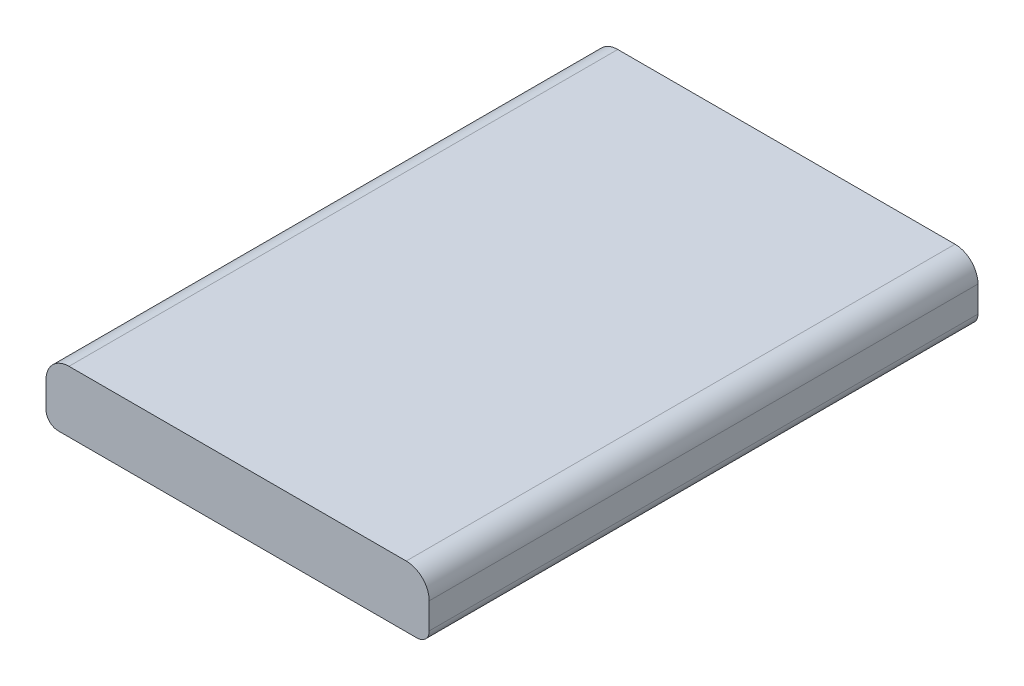
ISO-10303-21;
HEADER;
FILE_DESCRIPTION(('STEP AP214'),'2;1');
FILE_NAME('part.step','',(''),(''),'','','');
FILE_SCHEMA(('AUTOMOTIVE_DESIGN { 1 0 10303 214 1 1 1 1 }'));
ENDSEC;
DATA;
#1=APPLICATION_CONTEXT('core data for automotive mechanical design processes');
#2=APPLICATION_PROTOCOL_DEFINITION('international standard','automotive_design',2000,#1);
#3=PRODUCT_CONTEXT('',#1,'mechanical');
#4=PRODUCT('Part','Part','',(#3));
#5=PRODUCT_RELATED_PRODUCT_CATEGORY('part','',(#4));
#6=PRODUCT_DEFINITION_FORMATION('','',#4);
#7=PRODUCT_DEFINITION_CONTEXT('part definition',#1,'design');
#8=PRODUCT_DEFINITION('design','',#6,#7);
#9=PRODUCT_DEFINITION_SHAPE('','',#8);
#10=(LENGTH_UNIT() NAMED_UNIT(*) SI_UNIT(.MILLI.,.METRE.));
#11=(NAMED_UNIT(*) PLANE_ANGLE_UNIT() SI_UNIT($,.RADIAN.));
#12=(NAMED_UNIT(*) SI_UNIT($,.STERADIAN.) SOLID_ANGLE_UNIT());
#13=UNCERTAINTY_MEASURE_WITH_UNIT(LENGTH_MEASURE(1.E-05),#10,'distance_accuracy_value','');
#14=(GEOMETRIC_REPRESENTATION_CONTEXT(3) GLOBAL_UNCERTAINTY_ASSIGNED_CONTEXT((#13)) GLOBAL_UNIT_ASSIGNED_CONTEXT((#10,
#11,#12)) REPRESENTATION_CONTEXT('',''));
#15=CARTESIAN_POINT('',(0.,0.,0.));
#16=DIRECTION('',(0.,0.,1.));
#17=DIRECTION('',(1.,0.,0.));
#18=AXIS2_PLACEMENT_3D('',#15,#16,#17);
#19=CARTESIAN_POINT('',(12.5,4.,-17.9));
#20=DIRECTION('',(-1.,0.,0.));
#21=DIRECTION('',(0.,0.,1.));
#22=AXIS2_PLACEMENT_3D('',#19,#20,#21);
#23=PLANE('',#22);
#24=DIRECTION('',(0.,-1.,0.));
#25=VECTOR('',#24,1.);
#26=CARTESIAN_POINT('',(12.5,4.,17.9));
#27=LINE('',#26,#25);
#28=CARTESIAN_POINT('',(12.5,2.5,17.9));
#29=VERTEX_POINT('',#28);
#30=CARTESIAN_POINT('',(12.5,0.8,17.9));
#31=VERTEX_POINT('',#30);
#32=EDGE_CURVE('E130',#29,#31,#27,.T.);
#33=ORIENTED_EDGE('',*,*,#32,.T.);
#34=DIRECTION('',(0.,0.,-1.));
#35=VECTOR('',#34,1.);
#36=CARTESIAN_POINT('',(12.5,0.8,-17.9));
#37=LINE('',#36,#35);
#38=CARTESIAN_POINT('',(12.5,0.8,-17.9));
#39=VERTEX_POINT('',#38);
#40=EDGE_CURVE('E11',#31,#39,#37,.T.);
#41=ORIENTED_EDGE('',*,*,#40,.T.);
#42=DIRECTION('',(0.,-1.,0.));
#43=VECTOR('',#42,1.);
#44=CARTESIAN_POINT('',(12.5,4.,-17.9));
#45=LINE('',#44,#43);
#46=CARTESIAN_POINT('',(12.5,2.5,-17.9));
#47=VERTEX_POINT('',#46);
#48=EDGE_CURVE('E123',#47,#39,#45,.T.);
#49=ORIENTED_EDGE('',*,*,#48,.F.);
#50=DIRECTION('',(0.,0.,-1.));
#51=VECTOR('',#50,1.);
#52=CARTESIAN_POINT('',(12.5,2.5,17.9));
#53=LINE('',#52,#51);
#54=EDGE_CURVE('E105',#47,#29,#53,.F.);
#55=ORIENTED_EDGE('',*,*,#54,.T.);
#56=EDGE_LOOP('',(#33,#41,#49,#55));
#57=FACE_BOUND('',#56,.T.);
#58=ADVANCED_FACE('F33',(#57),#23,.F.);
#59=CARTESIAN_POINT('',(-12.5,4.,-17.9));
#60=DIRECTION('',(0.,0.,1.));
#61=DIRECTION('',(1.,0.,0.));
#62=AXIS2_PLACEMENT_3D('',#59,#60,#61);
#63=PLANE('',#62);
#64=DIRECTION('',(-1.,0.,0.));
#65=VECTOR('',#64,1.);
#66=CARTESIAN_POINT('',(-12.5,0.,-17.9));
#67=LINE('',#66,#65);
#68=CARTESIAN_POINT('',(11.7,0.,-17.9));
#69=VERTEX_POINT('',#68);
#70=CARTESIAN_POINT('',(-11.7,0.,-17.9));
#71=VERTEX_POINT('',#70);
#72=EDGE_CURVE('E133',#69,#71,#67,.T.);
#73=ORIENTED_EDGE('',*,*,#72,.T.);
#74=CARTESIAN_POINT('',(-11.7,0.8,-17.9));
#75=DIRECTION('',(0.,0.,1.));
#76=DIRECTION('',(1.,0.,0.));
#77=AXIS2_PLACEMENT_3D('',#74,#75,#76);
#78=CIRCLE('',#77,0.8);
#79=CARTESIAN_POINT('',(-12.5,0.8,-17.9));
#80=VERTEX_POINT('',#79);
#81=EDGE_CURVE('E41',#71,#80,#78,.F.);
#82=ORIENTED_EDGE('',*,*,#81,.T.);
#83=DIRECTION('',(0.,-1.,0.));
#84=VECTOR('',#83,1.);
#85=CARTESIAN_POINT('',(-12.5,4.,-17.9));
#86=LINE('',#85,#84);
#87=CARTESIAN_POINT('',(-12.5,2.5,-17.9));
#88=VERTEX_POINT('',#87);
#89=EDGE_CURVE('E142',#88,#80,#86,.T.);
#90=ORIENTED_EDGE('',*,*,#89,.F.);
#91=CARTESIAN_POINT('',(-11.,2.5,-17.9));
#92=DIRECTION('',(0.,0.,1.));
#93=DIRECTION('',(1.,0.,0.));
#94=AXIS2_PLACEMENT_3D('',#91,#92,#93);
#95=CIRCLE('',#94,1.5);
#96=CARTESIAN_POINT('',(-11.,4.,-17.9));
#97=VERTEX_POINT('',#96);
#98=EDGE_CURVE('E110',#88,#97,#95,.F.);
#99=ORIENTED_EDGE('',*,*,#98,.T.);
#100=DIRECTION('',(-1.,0.,0.));
#101=VECTOR('',#100,1.);
#102=CARTESIAN_POINT('',(-12.5,4.,-17.9));
#103=LINE('',#102,#101);
#104=CARTESIAN_POINT('',(11.,4.,-17.9));
#105=VERTEX_POINT('',#104);
#106=EDGE_CURVE('E118',#105,#97,#103,.T.);
#107=ORIENTED_EDGE('',*,*,#106,.F.);
#108=CARTESIAN_POINT('',(11.,2.5,-17.9));
#109=DIRECTION('',(0.,0.,1.));
#110=DIRECTION('',(1.,0.,0.));
#111=AXIS2_PLACEMENT_3D('',#108,#109,#110);
#112=CIRCLE('',#111,1.5);
#113=EDGE_CURVE('E100',#105,#47,#112,.F.);
#114=ORIENTED_EDGE('',*,*,#113,.T.);
#115=ORIENTED_EDGE('',*,*,#48,.T.);
#116=CARTESIAN_POINT('',(11.7,0.8,-17.9));
#117=DIRECTION('',(0.,0.,1.));
#118=DIRECTION('',(1.,0.,0.));
#119=AXIS2_PLACEMENT_3D('',#116,#117,#118);
#120=CIRCLE('',#119,0.8);
#121=EDGE_CURVE('E48',#39,#69,#120,.F.);
#122=ORIENTED_EDGE('',*,*,#121,.T.);
#123=EDGE_LOOP('',(#73,#82,#90,#99,#107,#114,#115,#122));
#124=FACE_BOUND('',#123,.T.);
#125=ADVANCED_FACE('F125',(#124),#63,.F.);
#126=CARTESIAN_POINT('',(-12.5,4.,-17.9));
#127=DIRECTION('',(1.,0.,0.));
#128=DIRECTION('',(0.,0.,-1.));
#129=AXIS2_PLACEMENT_3D('',#126,#127,#128);
#130=PLANE('',#129);
#131=ORIENTED_EDGE('',*,*,#89,.T.);
#132=DIRECTION('',(0.,0.,1.));
#133=VECTOR('',#132,1.);
#134=CARTESIAN_POINT('',(-12.5,0.8,-17.9));
#135=LINE('',#134,#133);
#136=CARTESIAN_POINT('',(-12.5,0.8,17.9));
#137=VERTEX_POINT('',#136);
#138=EDGE_CURVE('E154',#80,#137,#135,.T.);
#139=ORIENTED_EDGE('',*,*,#138,.T.);
#140=DIRECTION('',(0.,-1.,0.));
#141=VECTOR('',#140,1.);
#142=CARTESIAN_POINT('',(-12.5,4.,17.9));
#143=LINE('',#142,#141);
#144=CARTESIAN_POINT('',(-12.5,2.5,17.9));
#145=VERTEX_POINT('',#144);
#146=EDGE_CURVE('E139',#145,#137,#143,.T.);
#147=ORIENTED_EDGE('',*,*,#146,.F.);
#148=DIRECTION('',(0.,0.,1.));
#149=VECTOR('',#148,1.);
#150=CARTESIAN_POINT('',(-12.5,2.5,-17.9));
#151=LINE('',#150,#149);
#152=EDGE_CURVE('E111',#145,#88,#151,.F.);
#153=ORIENTED_EDGE('',*,*,#152,.T.);
#154=EDGE_LOOP('',(#131,#139,#147,#153));
#155=FACE_BOUND('',#154,.T.);
#156=ADVANCED_FACE('F168',(#155),#130,.F.);
#157=CARTESIAN_POINT('',(-12.5,4.,17.9));
#158=DIRECTION('',(0.,0.,-1.));
#159=DIRECTION('',(-1.,0.,0.));
#160=AXIS2_PLACEMENT_3D('',#157,#158,#159);
#161=PLANE('',#160);
#162=ORIENTED_EDGE('',*,*,#146,.T.);
#163=CARTESIAN_POINT('',(-11.7,0.8,17.9));
#164=DIRECTION('',(0.,0.,-1.));
#165=DIRECTION('',(-1.,0.,0.));
#166=AXIS2_PLACEMENT_3D('',#163,#164,#165);
#167=CIRCLE('',#166,0.8);
#168=CARTESIAN_POINT('',(-11.7,0.,17.9));
#169=VERTEX_POINT('',#168);
#170=EDGE_CURVE('E159',#137,#169,#167,.F.);
#171=ORIENTED_EDGE('',*,*,#170,.T.);
#172=DIRECTION('',(1.,0.,0.));
#173=VECTOR('',#172,1.);
#174=CARTESIAN_POINT('',(-12.5,0.,17.9));
#175=LINE('',#174,#173);
#176=CARTESIAN_POINT('',(11.7,0.,17.9));
#177=VERTEX_POINT('',#176);
#178=EDGE_CURVE('E128',#169,#177,#175,.T.);
#179=ORIENTED_EDGE('',*,*,#178,.T.);
#180=CARTESIAN_POINT('',(11.7,0.8,17.9));
#181=DIRECTION('',(0.,0.,-1.));
#182=DIRECTION('',(-1.,0.,0.));
#183=AXIS2_PLACEMENT_3D('',#180,#181,#182);
#184=CIRCLE('',#183,0.8);
#185=EDGE_CURVE('E157',#177,#31,#184,.F.);
#186=ORIENTED_EDGE('',*,*,#185,.T.);
#187=ORIENTED_EDGE('',*,*,#32,.F.);
#188=CARTESIAN_POINT('',(11.,2.5,17.9));
#189=DIRECTION('',(0.,0.,-1.));
#190=DIRECTION('',(-1.,0.,0.));
#191=AXIS2_PLACEMENT_3D('',#188,#189,#190);
#192=CIRCLE('',#191,1.5);
#193=CARTESIAN_POINT('',(11.,4.,17.9));
#194=VERTEX_POINT('',#193);
#195=EDGE_CURVE('E147',#29,#194,#192,.F.);
#196=ORIENTED_EDGE('',*,*,#195,.T.);
#197=DIRECTION('',(1.,0.,0.));
#198=VECTOR('',#197,1.);
#199=CARTESIAN_POINT('',(-12.5,4.,17.9));
#200=LINE('',#199,#198);
#201=CARTESIAN_POINT('',(-11.,4.,17.9));
#202=VERTEX_POINT('',#201);
#203=EDGE_CURVE('E121',#202,#194,#200,.T.);
#204=ORIENTED_EDGE('',*,*,#203,.F.);
#205=CARTESIAN_POINT('',(-11.,2.5,17.9));
#206=DIRECTION('',(0.,0.,-1.));
#207=DIRECTION('',(-1.,0.,0.));
#208=AXIS2_PLACEMENT_3D('',#205,#206,#207);
#209=CIRCLE('',#208,1.5);
#210=EDGE_CURVE('E149',#202,#145,#209,.F.);
#211=ORIENTED_EDGE('',*,*,#210,.T.);
#212=EDGE_LOOP('',(#162,#171,#179,#186,#187,#196,#204,#211));
#213=FACE_BOUND('',#212,.T.);
#214=ADVANCED_FACE('F173',(#213),#161,.F.);
#215=CARTESIAN_POINT('',(0.,4.,0.));
#216=DIRECTION('',(0.,1.,0.));
#217=DIRECTION('',(0.,0.,1.));
#218=AXIS2_PLACEMENT_3D('',#215,#216,#217);
#219=PLANE('',#218);
#220=ORIENTED_EDGE('',*,*,#106,.T.);
#221=DIRECTION('',(0.,0.,1.));
#222=VECTOR('',#221,1.);
#223=CARTESIAN_POINT('',(-11.,4.,17.9));
#224=LINE('',#223,#222);
#225=EDGE_CURVE('E122',#97,#202,#224,.T.);
#226=ORIENTED_EDGE('',*,*,#225,.T.);
#227=ORIENTED_EDGE('',*,*,#203,.T.);
#228=DIRECTION('',(0.,0.,-1.));
#229=VECTOR('',#228,1.);
#230=CARTESIAN_POINT('',(11.,4.,-17.9));
#231=LINE('',#230,#229);
#232=EDGE_CURVE('E104',#194,#105,#231,.T.);
#233=ORIENTED_EDGE('',*,*,#232,.T.);
#234=EDGE_LOOP('',(#220,#226,#227,#233));
#235=FACE_BOUND('',#234,.T.);
#236=ADVANCED_FACE('F116',(#235),#219,.T.);
#237=CARTESIAN_POINT('',(0.,0.,0.));
#238=DIRECTION('',(0.,1.,0.));
#239=DIRECTION('',(0.,0.,1.));
#240=AXIS2_PLACEMENT_3D('',#237,#238,#239);
#241=PLANE('',#240);
#242=ORIENTED_EDGE('',*,*,#178,.F.);
#243=DIRECTION('',(0.,0.,1.));
#244=VECTOR('',#243,1.);
#245=CARTESIAN_POINT('',(-11.7,0.,0.));
#246=LINE('',#245,#244);
#247=EDGE_CURVE('E55',#169,#71,#246,.F.);
#248=ORIENTED_EDGE('',*,*,#247,.T.);
#249=ORIENTED_EDGE('',*,*,#72,.F.);
#250=DIRECTION('',(0.,0.,-1.));
#251=VECTOR('',#250,1.);
#252=CARTESIAN_POINT('',(11.7,0.,0.));
#253=LINE('',#252,#251);
#254=EDGE_CURVE('E161',#69,#177,#253,.F.);
#255=ORIENTED_EDGE('',*,*,#254,.T.);
#256=EDGE_LOOP('',(#242,#248,#249,#255));
#257=FACE_BOUND('',#256,.T.);
#258=ADVANCED_FACE('F175',(#257),#241,.F.);
#259=CARTESIAN_POINT('',(-11.,2.5,0.));
#260=DIRECTION('',(0.,0.,-1.));
#261=DIRECTION('',(-1.,0.,0.));
#262=AXIS2_PLACEMENT_3D('',#259,#260,#261);
#263=CYLINDRICAL_SURFACE('',#262,1.5);
#264=ORIENTED_EDGE('',*,*,#98,.F.);
#265=ORIENTED_EDGE('',*,*,#152,.F.);
#266=ORIENTED_EDGE('',*,*,#210,.F.);
#267=ORIENTED_EDGE('',*,*,#225,.F.);
#268=EDGE_LOOP('',(#264,#265,#266,#267));
#269=FACE_BOUND('',#268,.T.);
#270=ADVANCED_FACE('F186',(#269),#263,.T.);
#271=CARTESIAN_POINT('',(11.,2.5,0.));
#272=DIRECTION('',(0.,0.,1.));
#273=DIRECTION('',(1.,0.,0.));
#274=AXIS2_PLACEMENT_3D('',#271,#272,#273);
#275=CYLINDRICAL_SURFACE('',#274,1.5);
#276=ORIENTED_EDGE('',*,*,#195,.F.);
#277=ORIENTED_EDGE('',*,*,#54,.F.);
#278=ORIENTED_EDGE('',*,*,#113,.F.);
#279=ORIENTED_EDGE('',*,*,#232,.F.);
#280=EDGE_LOOP('',(#276,#277,#278,#279));
#281=FACE_BOUND('',#280,.T.);
#282=ADVANCED_FACE('F103',(#281),#275,.T.);
#283=CARTESIAN_POINT('',(-11.7,0.8,-17.9));
#284=DIRECTION('',(0.,0.,1.));
#285=DIRECTION('',(1.,0.,0.));
#286=AXIS2_PLACEMENT_3D('',#283,#284,#285);
#287=CYLINDRICAL_SURFACE('',#286,0.8);
#288=ORIENTED_EDGE('',*,*,#81,.F.);
#289=ORIENTED_EDGE('',*,*,#247,.F.);
#290=ORIENTED_EDGE('',*,*,#170,.F.);
#291=ORIENTED_EDGE('',*,*,#138,.F.);
#292=EDGE_LOOP('',(#288,#289,#290,#291));
#293=FACE_BOUND('',#292,.T.);
#294=ADVANCED_FACE('F171',(#293),#287,.T.);
#295=CARTESIAN_POINT('',(11.7,0.8,-17.9));
#296=DIRECTION('',(0.,0.,-1.));
#297=DIRECTION('',(-1.,0.,0.));
#298=AXIS2_PLACEMENT_3D('',#295,#296,#297);
#299=CYLINDRICAL_SURFACE('',#298,0.8);
#300=ORIENTED_EDGE('',*,*,#185,.F.);
#301=ORIENTED_EDGE('',*,*,#254,.F.);
#302=ORIENTED_EDGE('',*,*,#121,.F.);
#303=ORIENTED_EDGE('',*,*,#40,.F.);
#304=EDGE_LOOP('',(#300,#301,#302,#303));
#305=FACE_BOUND('',#304,.T.);
#306=ADVANCED_FACE('F35',(#305),#299,.T.);
#307=CLOSED_SHELL('',(#58,#125,#156,#214,#236,#258,#270,#282,#294,#306));
#308=MANIFOLD_SOLID_BREP('B2',#307);
#309=ADVANCED_BREP_SHAPE_REPRESENTATION('',(#18,#308),#14);
#310=SHAPE_DEFINITION_REPRESENTATION(#9,#309);
ENDSEC;
END-ISO-10303-21;
